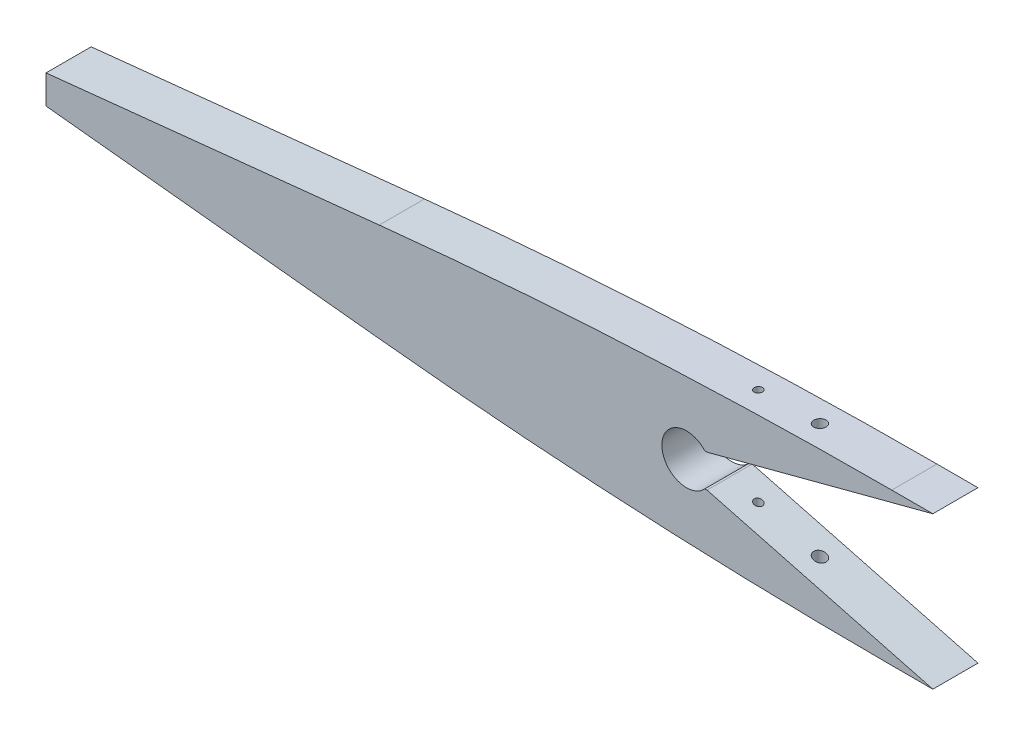
ISO-10303-21;
HEADER;
FILE_DESCRIPTION(('STEP AP214'),'2;1');
FILE_NAME('part.step','',(''),(''),'','','');
FILE_SCHEMA(('AUTOMOTIVE_DESIGN { 1 0 10303 214 1 1 1 1 }'));
ENDSEC;
DATA;
#1=APPLICATION_CONTEXT('core data for automotive mechanical design processes');
#2=APPLICATION_PROTOCOL_DEFINITION('international standard','automotive_design',2000,#1);
#3=PRODUCT_CONTEXT('',#1,'mechanical');
#4=PRODUCT('Part','Part','',(#3));
#5=PRODUCT_RELATED_PRODUCT_CATEGORY('part','',(#4));
#6=PRODUCT_DEFINITION_FORMATION('','',#4);
#7=PRODUCT_DEFINITION_CONTEXT('part definition',#1,'design');
#8=PRODUCT_DEFINITION('design','',#6,#7);
#9=PRODUCT_DEFINITION_SHAPE('','',#8);
#10=(LENGTH_UNIT() NAMED_UNIT(*) SI_UNIT(.MILLI.,.METRE.));
#11=(NAMED_UNIT(*) PLANE_ANGLE_UNIT() SI_UNIT($,.RADIAN.));
#12=(NAMED_UNIT(*) SI_UNIT($,.STERADIAN.) SOLID_ANGLE_UNIT());
#13=UNCERTAINTY_MEASURE_WITH_UNIT(LENGTH_MEASURE(1.E-05),#10,'distance_accuracy_value','');
#14=(GEOMETRIC_REPRESENTATION_CONTEXT(3) GLOBAL_UNCERTAINTY_ASSIGNED_CONTEXT((#13)) GLOBAL_UNIT_ASSIGNED_CONTEXT((#10,
#11,#12)) REPRESENTATION_CONTEXT('',''));
#15=CARTESIAN_POINT('',(0.,0.,0.));
#16=DIRECTION('',(0.,0.,1.));
#17=DIRECTION('',(1.,0.,0.));
#18=AXIS2_PLACEMENT_3D('',#15,#16,#17);
#19=CARTESIAN_POINT('',(-40.0000000000001,-1181.5,5.5));
#20=DIRECTION('',(0.,0.,-1.));
#21=DIRECTION('',(-1.,0.,0.));
#22=AXIS2_PLACEMENT_3D('',#19,#20,#21);
#23=CYLINDRICAL_SURFACE('',#22,1200.);
#24=CARTESIAN_POINT('',(-78.,17.8981824231681,1.));
#25=CARTESIAN_POINT('',(-78.0561923045698,17.8964021016881,0.999997511469249));
#26=CARTESIAN_POINT('',(-78.112425222722,17.8946165094137,0.995247784304634));
#27=CARTESIAN_POINT('',(-78.2233424947234,17.8910868344691,0.97636578145881));
#28=CARTESIAN_POINT('',(-78.2780249015019,17.8893428043943,0.962222210047299));
#29=CARTESIAN_POINT('',(-78.3842185929343,17.8859489689719,0.924953869738239));
#30=CARTESIAN_POINT('',(-78.4357313478532,17.8842991199639,0.901833301824797));
#31=CARTESIAN_POINT('',(-78.5341303227537,17.8811417671611,0.84727170926813));
#32=CARTESIAN_POINT('',(-78.581017693719,17.879634227958,0.815832761782682));
#33=CARTESIAN_POINT('',(-78.6688448755409,17.8768058328136,0.745526760569154));
#34=CARTESIAN_POINT('',(-78.7097853361787,17.8754849564773,0.706660519450606));
#35=CARTESIAN_POINT('',(-78.784561015701,17.8730692449622,0.622598289296068));
#36=CARTESIAN_POINT('',(-78.818395971903,17.8719744181402,0.57740206635067));
#37=CARTESIAN_POINT('',(-78.8779801540602,17.8700444611068,0.481988343305178));
#38=CARTESIAN_POINT('',(-78.9037334410808,17.8692092004646,0.431773381917891));
#39=CARTESIAN_POINT('',(-78.9464438970402,17.8678230497201,0.327728966665681));
#40=CARTESIAN_POINT('',(-78.9634011085648,17.8672721582409,0.273899530301524));
#41=CARTESIAN_POINT('',(-78.9880304900172,17.8664717807831,0.164181189129793));
#42=CARTESIAN_POINT('',(-78.9957069997004,17.8662221539299,0.108293259504111));
#43=CARTESIAN_POINT('',(-79.0015707600187,17.8660314879962,-0.00397858876548272));
#44=CARTESIAN_POINT('',(-78.9997580444487,17.8660904478167,-0.0603625056422744));
#45=CARTESIAN_POINT('',(-78.9866966264769,17.8665150936714,-0.172011848642425));
#46=CARTESIAN_POINT('',(-78.975450149958,17.8668807073511,-0.227277535460697));
#47=CARTESIAN_POINT('',(-78.943844333172,17.8679073730763,-0.335135735210378));
#48=CARTESIAN_POINT('',(-78.9234849825453,17.8685684254575,-0.387728245102819));
#49=CARTESIAN_POINT('',(-78.8742300378261,17.8701658967293,-0.488753760171055));
#50=CARTESIAN_POINT('',(-78.8453335170972,17.8711023455117,-0.537186313082427));
#51=CARTESIAN_POINT('',(-78.7798267506666,17.8732221904328,-0.628512663532799));
#52=CARTESIAN_POINT('',(-78.7432164936046,17.8744055869353,-0.671406452914571));
#53=CARTESIAN_POINT('',(-78.6633060701159,17.8769842541604,-0.750456507518725));
#54=CARTESIAN_POINT('',(-78.6200032177577,17.8783796099445,-0.786610054778484));
#55=CARTESIAN_POINT('',(-78.5279480298928,17.8813402491097,-0.851134715635319));
#56=CARTESIAN_POINT('',(-78.4791956785455,17.8829055329848,-0.879505806609433));
#57=CARTESIAN_POINT('',(-78.3775988240015,17.8861607046948,-0.927675197387078));
#58=CARTESIAN_POINT('',(-78.3247522587179,17.8878506552985,-0.947469143710317));
#59=CARTESIAN_POINT('',(-78.2164882670726,17.8913051860166,-0.977903208132851));
#60=CARTESIAN_POINT('',(-78.1610708346589,17.8930697663068,-0.988543304682029));
#61=CARTESIAN_POINT('',(-78.0492155969745,17.8966234419172,-1.0003708757492));
#62=CARTESIAN_POINT('',(-77.9927774111294,17.8984125463181,-1.00155474865937));
#63=CARTESIAN_POINT('',(-77.8805029908988,17.9019637503489,-0.994426750125098));
#64=CARTESIAN_POINT('',(-77.8246667571295,17.9037258499511,-0.986114868962242));
#65=CARTESIAN_POINT('',(-77.7151762144935,17.9071737675697,-0.960229270510509));
#66=CARTESIAN_POINT('',(-77.6615221040667,17.9088595786501,-0.942654712903967));
#67=CARTESIAN_POINT('',(-77.5579252683969,17.9121080504435,-0.898740843636251));
#68=CARTESIAN_POINT('',(-77.5079825396773,17.9136707112719,-0.872401540185299));
#69=CARTESIAN_POINT('',(-77.4132389062841,17.9166297845849,-0.811711529507555));
#70=CARTESIAN_POINT('',(-77.3684368335042,17.9180262348399,-0.777362647689904));
#71=CARTESIAN_POINT('',(-77.2852355019696,17.9206155263829,-0.701624106723934));
#72=CARTESIAN_POINT('',(-77.2468362318803,17.9218083680313,-0.660234460039761));
#73=CARTESIAN_POINT('',(-77.1775486834849,17.9239580225392,-0.571608511148883));
#74=CARTESIAN_POINT('',(-77.1466571358776,17.9249149381373,-0.524374767374718));
#75=CARTESIAN_POINT('',(-77.0932427802975,17.926568013743,-0.425387147485953));
#76=CARTESIAN_POINT('',(-77.0707199418596,17.9272641746999,-0.373633287827091));
#77=CARTESIAN_POINT('',(-77.0346927769226,17.9283771271634,-0.267099912885481));
#78=CARTESIAN_POINT('',(-77.0211843424603,17.928794045924,-0.212321788133247));
#79=CARTESIAN_POINT('',(-77.0035542030037,17.9293380834598,-0.101273789361552));
#80=CARTESIAN_POINT('',(-76.9994324967644,17.9294652022734,-0.0450039155399681));
#81=CARTESIAN_POINT('',(-77.000693047786,17.9294263166478,0.0674129024764315));
#82=CARTESIAN_POINT('',(-77.0060725700422,17.9292603965623,0.12355987739063));
#83=CARTESIAN_POINT('',(-77.0261771322758,17.9286399393485,0.234153368061977));
#84=CARTESIAN_POINT('',(-77.0409021866491,17.9281854017755,0.288599881199577));
#85=CARTESIAN_POINT('',(-77.0792790370669,17.9269996261495,0.394248102126137));
#86=CARTESIAN_POINT('',(-77.1029309896895,17.926268383243,0.445449752981682));
#87=CARTESIAN_POINT('',(-77.158487871994,17.9245485015111,0.54315311242878));
#88=CARTESIAN_POINT('',(-77.190392486903,17.923559872503,0.58965500018453));
#89=CARTESIAN_POINT('',(-77.2615542782081,17.9213512509488,0.676651116879112));
#90=CARTESIAN_POINT('',(-77.300812773185,17.9201312169103,0.717144266089301));
#91=CARTESIAN_POINT('',(-77.3855760051421,17.9174921605554,0.790975609200066));
#92=CARTESIAN_POINT('',(-77.4310823058293,17.9160730884215,0.824312006530038));
#93=CARTESIAN_POINT('',(-77.5270793329182,17.9130733919476,0.882899999760074));
#94=CARTESIAN_POINT('',(-77.5775746660115,17.9114926182497,0.908144030446657));
#95=CARTESIAN_POINT('',(-77.6820435661041,17.9082150429122,0.949767391137813));
#96=CARTESIAN_POINT('',(-77.736012888976,17.9065183827004,0.966157316398453));
#97=CARTESIAN_POINT('',(-77.8252710657469,17.9037060374184,0.985244099595972));
#98=CARTESIAN_POINT('',(-77.8599809400399,17.9026109119795,0.990770684049047));
#99=CARTESIAN_POINT('',(-77.929788589902,17.9004053514643,0.99814941224923));
#100=CARTESIAN_POINT('',(-77.9648863655719,17.8992949163839,1.00000155504138));
#101=CARTESIAN_POINT('',(-78.,17.8981824231681,1.));
#102=B_SPLINE_CURVE_WITH_KNOTS('',3,(#24,#25,#26,#27,#28,#29,#30,#31,#32,#33,#34,#35,#36,#37,
#38,#39,#40,#41,#42,#43,#44,#45,#46,#47,#48,#49,#50,#51,#52,#53,#54,#55,#56,#57,#58,#59,#60,#61,
#62,#63,#64,#65,#66,#67,#68,#69,#70,#71,#72,#73,#74,#75,#76,#77,#78,#79,#80,#81,#82,#83,#84,#85,
#86,#87,#88,#89,#90,#91,#92,#93,#94,#95,#96,#97,#98,#99,#100,#101),.UNSPECIFIED.,.T.,.F.,(4,2,2,
2,2,2,2,2,2,2,2,2,2,2,2,2,2,2,2,2,2,2,2,2,2,2,2,2,2,2,2,2,2,2,2,2,2,2,4),(0.,0.168533301244125,
0.337269624977658,0.505927079804669,0.674542459362489,0.843139401504723,1.01174257539011,
1.18026088945725,1.34877838764196,1.51721705472355,1.68565512192904,1.85405345758049,
2.02245198466915,2.19086879668608,2.35928585673646,2.52777068376531,2.69625600056052,
2.8648267351492,3.03339786658832,3.20203319893826,3.37066870387807,3.53931951020436,
3.70797015855043,3.87658240836244,4.04519435968615,4.21373275542084,4.38227053760755,
4.55073146272303,4.71919236549278,4.88760478334539,5.05601746062319,5.22443309200342,
5.39284230062544,5.56128173466327,5.72976340300015,5.89840212151824,6.06683858913986,
6.1721522123517,6.27746586293365),.UNSPECIFIED.);
#103=CARTESIAN_POINT('',(-78.,17.8981824231681,1.));
#104=VERTEX_POINT('',#103);
#105=EDGE_CURVE('E220',#104,#104,#102,.T.);
#106=ORIENTED_EDGE('',*,*,#105,.T.);
#107=EDGE_LOOP('',(#106));
#108=FACE_BOUND('',#107,.T.);
#109=CARTESIAN_POINT('',(-63.,18.279563086486,1.5));
#110=CARTESIAN_POINT('',(-63.084268391004,18.2779476328829,1.49999626486385));
#111=CARTESIAN_POINT('',(-63.1685977138507,18.2763220598821,1.49287503181335));
#112=CARTESIAN_POINT('',(-63.334933740548,18.2730984693798,1.46456577117715));
#113=CARTESIAN_POINT('',(-63.4169375241157,18.2715004874318,1.44336080856874));
#114=CARTESIAN_POINT('',(-63.576188843425,18.2683816721048,1.38748712495966));
#115=CARTESIAN_POINT('',(-63.6534386155935,18.2668608025102,1.35282479166792));
#116=CARTESIAN_POINT('',(-63.801001024803,18.2639425335107,1.27102835443357));
#117=CARTESIAN_POINT('',(-63.8713153833967,18.2625451034738,1.22389735629278));
#118=CARTESIAN_POINT('',(-64.0030372452952,18.2599170461059,1.11849505816259));
#119=CARTESIAN_POINT('',(-64.0644444649641,18.2586864240868,1.06022340355084));
#120=CARTESIAN_POINT('',(-64.1766062422245,18.2564314750849,0.934191730724932));
#121=CARTESIAN_POINT('',(-64.2273603906187,18.2554071560266,0.866431348203955));
#122=CARTESIAN_POINT('',(-64.3167616314828,18.2535984984839,0.723362077671816));
#123=CARTESIAN_POINT('',(-64.3554111586081,18.2528141117417,0.648054711645801));
#124=CARTESIAN_POINT('',(-64.4195183805673,18.2515110038544,0.492018116121068));
#125=CARTESIAN_POINT('',(-64.4449761166913,18.2509922818778,0.411288903593513));
#126=CARTESIAN_POINT('',(-64.481972709497,18.2502379071288,0.246716088114577));
#127=CARTESIAN_POINT('',(-64.493514123939,18.2500022023389,0.162873060390027));
#128=CARTESIAN_POINT('',(-64.5023585114665,18.2498216077616,-0.00556078360040504));
#129=CARTESIAN_POINT('',(-64.4996615203241,18.2498767172437,-0.0901515979870423));
#130=CARTESIAN_POINT('',(-64.4801067875594,18.2502758763135,-0.257671390609197));
#131=CARTESIAN_POINT('',(-64.4632503957534,18.2506198983593,-0.340600526481078));
#132=CARTESIAN_POINT('',(-64.4158576809386,18.2515853087197,-0.502451478277224));
#133=CARTESIAN_POINT('',(-64.3853213428681,18.2522066973397,-0.58137328978931));
#134=CARTESIAN_POINT('',(-64.3114347353344,18.2537061829468,-0.732973184581863));
#135=CARTESIAN_POINT('',(-64.2680839043511,18.254584291183,-0.805650994075276));
#136=CARTESIAN_POINT('',(-64.169800215829,18.256568294269,-0.942697088136512));
#137=CARTESIAN_POINT('',(-64.1148673540699,18.2576741892017,-1.00706536967632));
#138=CARTESIAN_POINT('',(-63.9949696353639,18.2600781070473,-1.12567649895182));
#139=CARTESIAN_POINT('',(-63.9300031649375,18.2613761608593,-1.17991771507513));
#140=CARTESIAN_POINT('',(-63.791889064135,18.2641229747671,-1.27672372222491));
#141=CARTESIAN_POINT('',(-63.7187414238095,18.265571735046,-1.3192884990509));
#142=CARTESIAN_POINT('',(-63.5663259851008,18.2685752193436,-1.39154195577727));
#143=CARTESIAN_POINT('',(-63.4870569940957,18.2701299640042,-1.42122811904522));
#144=CARTESIAN_POINT('',(-63.3246612529595,18.273298072829,-1.46687047473541));
#145=CARTESIAN_POINT('',(-63.2415344996476,18.2749114370416,-1.4828266558368));
#146=CARTESIAN_POINT('',(-63.0737707826003,18.2781495509018,-1.50055776108226));
#147=CARTESIAN_POINT('',(-62.9891336147561,18.2797743020699,-1.50233075382314));
#148=CARTESIAN_POINT('',(-62.8207625486686,18.2829886640278,-1.49163994264656));
#149=CARTESIAN_POINT('',(-62.7370286507214,18.284578274806,-1.47917613406473));
#150=CARTESIAN_POINT('',(-62.5728394711434,18.2876785765638,-1.44036458166167));
#151=CARTESIAN_POINT('',(-62.4923842565002,18.2891892659312,-1.41401655432095));
#152=CARTESIAN_POINT('',(-62.3370387947724,18.2920914638732,-1.34818358453718));
#153=CARTESIAN_POINT('',(-62.2621485449322,18.2934829725069,-1.30869864859895));
#154=CARTESIAN_POINT('',(-62.1200667185898,18.2961108889721,-1.21771631068243));
#155=CARTESIAN_POINT('',(-62.0528744223044,18.2973473113057,-1.16622003317215));
#156=CARTESIAN_POINT('',(-61.9280890806706,18.2996344440375,-1.05267420127906));
#157=CARTESIAN_POINT('',(-61.8704960315715,18.3006851545084,-0.990624651019752));
#158=CARTESIAN_POINT('',(-61.7665539340837,18.302575359673,-0.85774412586558));
#159=CARTESIAN_POINT('',(-61.7202031139188,18.30341488765,-0.786914537367736));
#160=CARTESIAN_POINT('',(-61.6400508244645,18.3048632232596,-0.638476893145027));
#161=CARTESIAN_POINT('',(-61.6062493309074,18.3054720313385,-0.560868850528605));
#162=CARTESIAN_POINT('',(-61.552160509812,18.3064448543933,-0.401090278981988));
#163=CARTESIAN_POINT('',(-61.5318710819865,18.3068089074137,-0.318920461276735));
#164=CARTESIAN_POINT('',(-61.5053745289112,18.3072841271803,-0.152340007949402));
#165=CARTESIAN_POINT('',(-61.4991674200805,18.3073952936317,-0.0679293697147729));
#166=CARTESIAN_POINT('',(-61.5010118747468,18.3073622415458,0.100727797739616));
#167=CARTESIAN_POINT('',(-61.5090620713395,18.3072180474907,0.1849743419165));
#168=CARTESIAN_POINT('',(-61.5391897736638,18.3066775642791,0.350920078164403));
#169=CARTESIAN_POINT('',(-61.5612673053387,18.3062812746562,0.432619265523836));
#170=CARTESIAN_POINT('',(-61.6188228982638,18.3052455792231,0.591152554846929));
#171=CARTESIAN_POINT('',(-61.6543012031258,18.3046061689932,0.667986568337284));
#172=CARTESIAN_POINT('',(-61.7376490054178,18.3030989897291,0.814604503166964));
#173=CARTESIAN_POINT('',(-61.7855180206612,18.3022312295813,0.88438869870427));
#174=CARTESIAN_POINT('',(-61.8922870792391,18.3002878017794,1.01492982275097));
#175=CARTESIAN_POINT('',(-61.951186996895,18.2992121364941,1.07568685409553));
#176=CARTESIAN_POINT('',(-62.0783648864703,18.2968785756373,1.18646570917636));
#177=CARTESIAN_POINT('',(-62.1466451924555,18.295620634707,1.23648485310533));
#178=CARTESIAN_POINT('',(-62.290668673416,18.292953503864,1.32437673103315));
#179=CARTESIAN_POINT('',(-62.3664165392296,18.2915442188324,1.36224176591028));
#180=CARTESIAN_POINT('',(-62.52313263984,18.2886124699497,1.42467391328725));
#181=CARTESIAN_POINT('',(-62.6040944922602,18.2870901441337,1.4492569504207));
#182=CARTESIAN_POINT('',(-62.7379765466488,18.2845586151354,1.47787803152235));
#183=CARTESIAN_POINT('',(-62.7900274189789,18.2835710620329,1.48616343820907));
#184=CARTESIAN_POINT('',(-62.8947109304134,18.2815780185139,1.49722558966781));
#185=CARTESIAN_POINT('',(-62.9473435695686,18.2805725280958,1.50000233395862));
#186=CARTESIAN_POINT('',(-63.,18.279563086486,1.5));
#187=B_SPLINE_CURVE_WITH_KNOTS('',3,(#109,#110,#111,#112,#113,#114,#115,#116,#117,#118,#119,
#120,#121,#122,#123,#124,#125,#126,#127,#128,#129,#130,#131,#132,#133,#134,#135,#136,#137,#138,
#139,#140,#141,#142,#143,#144,#145,#146,#147,#148,#149,#150,#151,#152,#153,#154,#155,#156,#157,
#158,#159,#160,#161,#162,#163,#164,#165,#166,#167,#168,#169,#170,#171,#172,#173,#174,#175,#176,
#177,#178,#179,#180,#181,#182,#183,#184,#185,#186),.UNSPECIFIED.,.T.,.F.,(4,2,2,2,2,2,2,2,2,2,2,
2,2,2,2,2,2,2,2,2,2,2,2,2,2,2,2,2,2,2,2,2,2,2,2,2,2,2,4),(0.,0.252659404385438,
0.505623171197716,0.758467012112514,1.01124793171994,1.26403689903027,1.51683557449197,
1.76958337074934,2.02233037590642,2.27503092016356,2.5277308295452,2.78040665176718,
3.03308275218645,3.28576992630089,3.53845719249512,3.79118513508948,4.04391338504145,
4.29669099884224,4.54946882106691,4.80228106485981,5.05509339148112,5.30791088079833,
5.56072824493142,5.81352195050695,6.06631555730846,6.31906929789117,6.57182254969948,
6.82453650489413,7.07725075473824,7.32994077718019,7.58263126696936,7.83532635062235,
8.08801160208105,8.34069397479273,8.5934393352102,8.84634448476051,9.09894573350175,
9.25682392518391,9.41470213065773),.UNSPECIFIED.);
#188=CARTESIAN_POINT('',(-63.,18.279563086486,1.5));
#189=VERTEX_POINT('',#188);
#190=EDGE_CURVE('E139',#189,#189,#187,.T.);
#191=ORIENTED_EDGE('',*,*,#190,.T.);
#192=EDGE_LOOP('',(#191));
#193=FACE_BOUND('',#192,.T.);
#194=CARTESIAN_POINT('',(-40.0000000000001,-1181.5,-5.5));
#195=DIRECTION('',(0.,0.,1.));
#196=DIRECTION('',(1.,0.,0.));
#197=AXIS2_PLACEMENT_3D('',#194,#195,#196);
#198=CIRCLE('',#197,1200.);
#199=CARTESIAN_POINT('',(-40.,18.5,-5.5));
#200=VERTEX_POINT('',#199);
#201=CARTESIAN_POINT('',(-164.827821896912,11.9898469951354,-5.5));
#202=VERTEX_POINT('',#201);
#203=EDGE_CURVE('E125',#200,#202,#198,.T.);
#204=ORIENTED_EDGE('',*,*,#203,.T.);
#205=DIRECTION('',(0.,0.,-1.));
#206=VECTOR('',#205,1.);
#207=CARTESIAN_POINT('',(-164.827821896912,11.9898469951354,5.5));
#208=LINE('',#207,#206);
#209=CARTESIAN_POINT('',(-164.827821896912,11.9898469951354,5.5));
#210=VERTEX_POINT('',#209);
#211=EDGE_CURVE('E11',#210,#202,#208,.T.);
#212=ORIENTED_EDGE('',*,*,#211,.F.);
#213=CARTESIAN_POINT('',(-40.0000000000001,-1181.5,5.5));
#214=DIRECTION('',(0.,0.,1.));
#215=DIRECTION('',(1.,0.,0.));
#216=AXIS2_PLACEMENT_3D('',#213,#214,#215);
#217=CIRCLE('',#216,1200.);
#218=CARTESIAN_POINT('',(-40.,18.5,5.5));
#219=VERTEX_POINT('',#218);
#220=EDGE_CURVE('E168',#219,#210,#217,.T.);
#221=ORIENTED_EDGE('',*,*,#220,.F.);
#222=DIRECTION('',(0.,0.,-1.));
#223=VECTOR('',#222,1.);
#224=CARTESIAN_POINT('',(-40.,18.5,5.5));
#225=LINE('',#224,#223);
#226=EDGE_CURVE('E138',#219,#200,#225,.T.);
#227=ORIENTED_EDGE('',*,*,#226,.T.);
#228=EDGE_LOOP('',(#204,#212,#221,#227));
#229=FACE_BOUND('',#228,.T.);
#230=ADVANCED_FACE('F30',(#108,#193,#229),#23,.T.);
#231=CARTESIAN_POINT('',(-164.827821896912,11.9898469951354,5.5));
#232=DIRECTION('',(0.10402318491409,-0.994574872495947,0.));
#233=DIRECTION('',(0.994574872495947,0.10402318491409,0.));
#234=AXIS2_PLACEMENT_3D('',#231,#232,#233);
#235=PLANE('',#234);
#236=DIRECTION('',(-0.994574872495947,-0.104023184914089,0.));
#237=VECTOR('',#236,1.);
#238=CARTESIAN_POINT('',(-164.827821896912,11.9898469951354,-5.5));
#239=LINE('',#238,#237);
#240=CARTESIAN_POINT('',(-246.,3.5,-5.5));
#241=VERTEX_POINT('',#240);
#242=EDGE_CURVE('E121',#202,#241,#239,.T.);
#243=ORIENTED_EDGE('',*,*,#242,.T.);
#244=DIRECTION('',(0.,0.,-1.));
#245=VECTOR('',#244,1.);
#246=CARTESIAN_POINT('',(-246.,3.5,5.5));
#247=LINE('',#246,#245);
#248=CARTESIAN_POINT('',(-246.,3.5,5.5));
#249=VERTEX_POINT('',#248);
#250=EDGE_CURVE('E39',#249,#241,#247,.T.);
#251=ORIENTED_EDGE('',*,*,#250,.F.);
#252=DIRECTION('',(-0.994574872495947,-0.104023184914089,0.));
#253=VECTOR('',#252,1.);
#254=CARTESIAN_POINT('',(-164.827821896912,11.9898469951354,5.5));
#255=LINE('',#254,#253);
#256=EDGE_CURVE('E134',#210,#249,#255,.T.);
#257=ORIENTED_EDGE('',*,*,#256,.F.);
#258=ORIENTED_EDGE('',*,*,#211,.T.);
#259=EDGE_LOOP('',(#243,#251,#257,#258));
#260=FACE_BOUND('',#259,.T.);
#261=ADVANCED_FACE('F133',(#260),#235,.F.);
#262=CARTESIAN_POINT('',(-246.,-3.5,5.5));
#263=DIRECTION('',(1.,0.,0.));
#264=DIRECTION('',(0.,0.,-1.));
#265=AXIS2_PLACEMENT_3D('',#262,#263,#264);
#266=PLANE('',#265);
#267=DIRECTION('',(0.,-1.,0.));
#268=VECTOR('',#267,1.);
#269=CARTESIAN_POINT('',(-246.,-3.5,-5.5));
#270=LINE('',#269,#268);
#271=CARTESIAN_POINT('',(-246.,-3.5,-5.5));
#272=VERTEX_POINT('',#271);
#273=EDGE_CURVE('E127',#241,#272,#270,.T.);
#274=ORIENTED_EDGE('',*,*,#273,.T.);
#275=DIRECTION('',(0.,0.,-1.));
#276=VECTOR('',#275,1.);
#277=CARTESIAN_POINT('',(-246.,-3.5,5.5));
#278=LINE('',#277,#276);
#279=CARTESIAN_POINT('',(-246.,-3.5,5.5));
#280=VERTEX_POINT('',#279);
#281=EDGE_CURVE('E214',#280,#272,#278,.T.);
#282=ORIENTED_EDGE('',*,*,#281,.F.);
#283=DIRECTION('',(0.,-1.,0.));
#284=VECTOR('',#283,1.);
#285=CARTESIAN_POINT('',(-246.,-3.5,5.5));
#286=LINE('',#285,#284);
#287=EDGE_CURVE('E171',#249,#280,#286,.T.);
#288=ORIENTED_EDGE('',*,*,#287,.F.);
#289=ORIENTED_EDGE('',*,*,#250,.T.);
#290=EDGE_LOOP('',(#274,#282,#288,#289));
#291=FACE_BOUND('',#290,.T.);
#292=ADVANCED_FACE('F269',(#291),#266,.F.);
#293=CARTESIAN_POINT('',(-164.827821896912,-11.9898469951354,5.5));
#294=DIRECTION('',(0.10402318491409,0.994574872495947,0.));
#295=DIRECTION('',(-0.994574872495947,0.10402318491409,0.));
#296=AXIS2_PLACEMENT_3D('',#293,#294,#295);
#297=PLANE('',#296);
#298=DIRECTION('',(0.994574872495947,-0.10402318491409,0.));
#299=VECTOR('',#298,1.);
#300=CARTESIAN_POINT('',(-164.827821896912,-11.9898469951354,-5.5));
#301=LINE('',#300,#299);
#302=CARTESIAN_POINT('',(-164.827821896912,-11.9898469951356,-5.5));
#303=VERTEX_POINT('',#302);
#304=EDGE_CURVE('E150',#272,#303,#301,.T.);
#305=ORIENTED_EDGE('',*,*,#304,.T.);
#306=DIRECTION('',(0.,0.,-1.));
#307=VECTOR('',#306,1.);
#308=CARTESIAN_POINT('',(-164.827821896912,-11.9898469951356,5.5));
#309=LINE('',#308,#307);
#310=CARTESIAN_POINT('',(-164.827821896912,-11.9898469951356,5.5));
#311=VERTEX_POINT('',#310);
#312=EDGE_CURVE('E211',#311,#303,#309,.T.);
#313=ORIENTED_EDGE('',*,*,#312,.F.);
#314=DIRECTION('',(0.994574872495947,-0.10402318491409,0.));
#315=VECTOR('',#314,1.);
#316=CARTESIAN_POINT('',(-164.827821896912,-11.9898469951354,5.5));
#317=LINE('',#316,#315);
#318=EDGE_CURVE('E173',#280,#311,#317,.T.);
#319=ORIENTED_EDGE('',*,*,#318,.F.);
#320=ORIENTED_EDGE('',*,*,#281,.T.);
#321=EDGE_LOOP('',(#305,#313,#319,#320));
#322=FACE_BOUND('',#321,.T.);
#323=ADVANCED_FACE('F263',(#322),#297,.F.);
#324=CARTESIAN_POINT('',(-40.0000000000001,1181.5,5.5));
#325=DIRECTION('',(0.,0.,-1.));
#326=DIRECTION('',(-1.,0.,0.));
#327=AXIS2_PLACEMENT_3D('',#324,#325,#326);
#328=CYLINDRICAL_SURFACE('',#327,1200.);
#329=CARTESIAN_POINT('',(-78.,-17.8981824231681,1.));
#330=CARTESIAN_POINT('',(-77.9438095570607,-17.8999626743733,0.999997511841235));
#331=CARTESIAN_POINT('',(-77.8875782605472,-17.9017402361374,0.995248100710178));
#332=CARTESIAN_POINT('',(-77.776663671379,-17.9052387625665,0.976367108322347));
#333=CARTESIAN_POINT('',(-77.7219823240673,-17.9069596565106,0.962224237636076));
#334=CARTESIAN_POINT('',(-77.6157901763367,-17.9102947492261,0.924957454943618));
#335=CARTESIAN_POINT('',(-77.5642779105168,-17.9119089973369,0.901837730598396));
#336=CARTESIAN_POINT('',(-77.4658795907971,-17.9149866884113,0.847277911000365));
#337=CARTESIAN_POINT('',(-77.4189923862197,-17.9164501688887,0.815839892475271));
#338=CARTESIAN_POINT('',(-77.3311661875213,-17.9191869253241,0.745536554542783));
#339=CARTESIAN_POINT('',(-77.2902264319194,-17.9204602256323,0.70667218744495));
#340=CARTESIAN_POINT('',(-77.2154517249991,-17.922782656732,0.622614173463215));
#341=CARTESIAN_POINT('',(-77.1816170368252,-17.9238317792207,0.577420292261564));
#342=CARTESIAN_POINT('',(-77.1220322145506,-17.9256774038633,0.482010752397367));
#343=CARTESIAN_POINT('',(-77.0962781819874,-17.9264740278354,0.431797530750296));
#344=CARTESIAN_POINT('',(-77.053565820216,-17.9277942916162,0.327756801616687));
#345=CARTESIAN_POINT('',(-77.0366074510429,-17.9283179326654,0.273929310553562));
#346=CARTESIAN_POINT('',(-77.0119745951541,-17.9290783076662,0.164212184994893));
#347=CARTESIAN_POINT('',(-77.0042962234525,-17.9293151616787,0.108323423536548));
#348=CARTESIAN_POINT('',(-76.9984290686087,-17.9294961586855,-0.00395033778985625));
#349=CARTESIAN_POINT('',(-77.0002402538572,-17.9294403026547,-0.0603353360043511));
#350=CARTESIAN_POINT('',(-77.0132992187128,-17.9290373851685,-0.171988948328424));
#351=CARTESIAN_POINT('',(-77.0245450723815,-17.928690383146,-0.227257787926257));
#352=CARTESIAN_POINT('',(-77.056150752336,-17.9277143451834,-0.335122406198049));
#353=CARTESIAN_POINT('',(-77.0765105884822,-17.9270853089382,-0.387718181979987));
#354=CARTESIAN_POINT('',(-77.1257673189202,-17.9255616773973,-0.488749317596763));
#355=CARTESIAN_POINT('',(-77.1546650094635,-17.9246670573328,-0.537184288845521));
#356=CARTESIAN_POINT('',(-77.2201750563672,-17.9226359540912,-0.628515152850696));
#357=CARTESIAN_POINT('',(-77.2567874218875,-17.9214994706269,-0.67141103903034));
#358=CARTESIAN_POINT('',(-77.3367009296429,-17.9190145059791,-0.750462718766892));
#359=CARTESIAN_POINT('',(-77.380004437612,-17.9176659498118,-0.786616118420015));
#360=CARTESIAN_POINT('',(-77.4720609335613,-17.9147934582372,-0.8511403005693));
#361=CARTESIAN_POINT('',(-77.5208139360237,-17.9132695223638,-0.879511062382224));
#362=CARTESIAN_POINT('',(-77.6224100354448,-17.9100870195827,-0.927678700101578));
#363=CARTESIAN_POINT('',(-77.6752550493625,-17.9084283895577,-0.947471528564486));
#364=CARTESIAN_POINT('',(-77.7835153305017,-17.905022876038,-0.977903888928883));
#365=CARTESIAN_POINT('',(-77.8389306038278,-17.9032759923338,-0.98854339908962));
#366=CARTESIAN_POINT('',(-77.9507815194917,-17.8997420848618,-1.00037062856367));
#367=CARTESIAN_POINT('',(-78.0072175523588,-17.8979550456648,-1.0015546502433));
#368=CARTESIAN_POINT('',(-78.1194872877155,-17.8943921178387,-0.994427785426345));
#369=CARTESIAN_POINT('',(-78.1753209894244,-17.8926162292241,-0.986116886624779));
#370=CARTESIAN_POINT('',(-78.2848089704863,-17.8891263489767,-0.960233652217093));
#371=CARTESIAN_POINT('',(-78.3384629497539,-17.8874123658702,-0.942660046024057));
#372=CARTESIAN_POINT('',(-78.4420595138033,-17.8840964215386,-0.898748296490603));
#373=CARTESIAN_POINT('',(-78.4920021010654,-17.8824944602387,-0.872410159007522));
#374=CARTESIAN_POINT('',(-78.5867475444491,-17.8794500338543,-0.811721428017472));
#375=CARTESIAN_POINT('',(-78.631551368055,-17.8780075387487,-0.777372346451723));
#376=CARTESIAN_POINT('',(-78.7147560505924,-17.8753246587704,-0.701632837614517));
#377=CARTESIAN_POINT('',(-78.7531569207884,-17.8740842735422,-0.660242422730943));
#378=CARTESIAN_POINT('',(-78.8224472487807,-17.8718434223694,-0.571614509484403));
#379=CARTESIAN_POINT('',(-78.8533400138194,-17.8708428507922,-0.524379599448448));
#380=CARTESIAN_POINT('',(-78.9067564387838,-17.8691112500445,-0.425389044766558));
#381=CARTESIAN_POINT('',(-78.9292801313266,-17.8683802198235,-0.37363341774033));
#382=CARTESIAN_POINT('',(-78.965307615026,-17.867210294442,-0.267098407714894));
#383=CARTESIAN_POINT('',(-78.9788159147315,-17.8667712532596,-0.212320550978178));
#384=CARTESIAN_POINT('',(-78.9964458676324,-17.8661981599624,-0.101272961602289));
#385=CARTESIAN_POINT('',(-79.0005675247259,-17.866064107721,-0.0450032295826883));
#386=CARTESIAN_POINT('',(-78.9993069453199,-17.8661050980567,0.0674109156485293));
#387=CARTESIAN_POINT('',(-78.9939278431163,-17.8662800386973,0.123555364073284));
#388=CARTESIAN_POINT('',(-78.9738250053265,-17.8669334545759,0.234143849576105));
#389=CARTESIAN_POINT('',(-78.9591012557436,-17.8674119302686,0.288587884107089));
#390=CARTESIAN_POINT('',(-78.9207279713706,-17.8686577946925,0.394231328341517));
#391=CARTESIAN_POINT('',(-78.8970782809847,-17.8694251884601,0.4454306814659));
#392=CARTESIAN_POINT('',(-78.8415269,-17.8712254998377,0.543129900724581));
#393=CARTESIAN_POINT('',(-78.80962552217,-17.8722584073839,0.589629944886713));
#394=CARTESIAN_POINT('',(-78.7384695776985,-17.8745587757839,0.676624990737614));
#395=CARTESIAN_POINT('',(-78.6992133848995,-17.8758262885085,0.717118660856194));
#396=CARTESIAN_POINT('',(-78.6144548594173,-17.8785581165731,0.790951544347248));
#397=CARTESIAN_POINT('',(-78.5689509613476,-17.880022481233,0.824288959309541));
#398=CARTESIAN_POINT('',(-78.4729564201835,-17.8831055718505,0.882880925060902));
#399=CARTESIAN_POINT('',(-78.4224609500679,-17.8847244471719,0.908127549721704));
#400=CARTESIAN_POINT('',(-78.3179910032604,-17.888066592868,0.949755901272914));
#401=CARTESIAN_POINT('',(-78.2640207711006,-17.8897897357272,0.966148222375121));
#402=CARTESIAN_POINT('',(-78.1747562838106,-17.892633448501,0.985239438483833));
#403=CARTESIAN_POINT('',(-78.1400411838709,-17.8937378851609,0.990767752180665));
#404=CARTESIAN_POINT('',(-78.0702227089306,-17.8959560391285,0.998148811022522));
#405=CARTESIAN_POINT('',(-78.0351193338185,-17.8970697564389,1.00000155511282));
#406=CARTESIAN_POINT('',(-78.,-17.8981824231681,1.));
#407=B_SPLINE_CURVE_WITH_KNOTS('',3,(#329,#330,#331,#332,#333,#334,#335,#336,#337,#338,#339,
#340,#341,#342,#343,#344,#345,#346,#347,#348,#349,#350,#351,#352,#353,#354,#355,#356,#357,#358,
#359,#360,#361,#362,#363,#364,#365,#366,#367,#368,#369,#370,#371,#372,#373,#374,#375,#376,#377,
#378,#379,#380,#381,#382,#383,#384,#385,#386,#387,#388,#389,#390,#391,#392,#393,#394,#395,#396,
#397,#398,#399,#400,#401,#402,#403,#404,#405,#406),.UNSPECIFIED.,.T.,.F.,(4,2,2,2,2,2,2,2,2,2,2,
2,2,2,2,2,2,2,2,2,2,2,2,2,2,2,2,2,2,2,2,2,2,2,2,2,2,2,4),(0.,0.168527698476664,
0.337258307566258,0.505910298988337,0.674520224774949,0.843108543547335,1.0117031050868,
1.18021620370989,1.34872853665316,1.51717029898716,1.68561150025043,1.85401832527137,
2.02242533248987,2.19084805052467,2.35927096853257,2.52775357132561,2.69623662187583,
2.8647990837628,3.03336194601437,3.20199072270402,3.37061971792904,3.53927185040408,
3.70792387016913,3.87654408520805,4.04516400359491,4.21370951148867,4.38225436249763,
4.5507148618597,4.71917529126162,4.88758015602804,5.05598527303909,5.22439332580312,
5.3927949962312,5.56123394448546,5.72971517303791,5.89836095292266,6.06680449790107,
6.17213519992968,6.27746593218353),.UNSPECIFIED.);
#408=CARTESIAN_POINT('',(-78.,-17.8981824231681,1.));
#409=VERTEX_POINT('',#408);
#410=EDGE_CURVE('E226',#409,#409,#407,.T.);
#411=ORIENTED_EDGE('',*,*,#410,.T.);
#412=EDGE_LOOP('',(#411));
#413=FACE_BOUND('',#412,.T.);
#414=CARTESIAN_POINT('',(-63.,-18.279563086486,1.5));
#415=CARTESIAN_POINT('',(-62.9157341421218,-18.2811784661517,1.49999626537085));
#416=CARTESIAN_POINT('',(-62.8314070259426,-18.2827860693684,1.49287546225001));
#417=CARTESIAN_POINT('',(-62.6650746501325,-18.2859397968327,1.46456757628875));
#418=CARTESIAN_POINT('',(-62.5830723084334,-18.2874858447246,1.44336356699848));
#419=CARTESIAN_POINT('',(-62.4238230902503,-18.2904727485298,1.38749200252342));
#420=CARTESIAN_POINT('',(-62.3465739839619,-18.2919136538267,1.35283081692579));
#421=CARTESIAN_POINT('',(-62.1990124669922,-18.2946529712941,1.27103679181813));
#422=CARTESIAN_POINT('',(-62.1286983351766,-18.295951418829,1.22390705752137));
#423=CARTESIAN_POINT('',(-61.9969778117579,-18.2983736087522,1.11850838253607));
#424=CARTESIAN_POINT('',(-61.9355715518016,-18.2994973485584,1.06023927725164));
#425=CARTESIAN_POINT('',(-61.8234110989732,-18.3015427073451,0.934213339505747));
#426=CARTESIAN_POINT('',(-61.7726573159219,-18.3024643185493,0.866456142186721));
#427=CARTESIAN_POINT('',(-61.683255206698,-18.3040833610534,0.723392563724161));
#428=CARTESIAN_POINT('',(-61.6446046665989,-18.3047808333533,0.648087566555707));
#429=CARTESIAN_POINT('',(-61.5804948541377,-18.305935672853,0.492055990275512));
#430=CARTESIAN_POINT('',(-61.5550355440438,-18.3063930407395,0.411329426672269));
#431=CARTESIAN_POINT('',(-61.5180342240754,-18.3070572176029,0.246758271008589));
#432=CARTESIAN_POINT('',(-61.5064902750925,-18.3072640614904,0.16291411506423));
#433=CARTESIAN_POINT('',(-61.4976412658055,-18.3074226476949,-0.00552232443309925));
#434=CARTESIAN_POINT('',(-61.5003361727091,-18.3073743905994,-0.0901146062626771));
#435=CARTESIAN_POINT('',(-61.5198875619682,-18.3070238721335,-0.257640204847128));
#436=CARTESIAN_POINT('',(-61.5367431035577,-18.3067216276367,-0.340573631433813));
#437=CARTESIAN_POINT('',(-61.5841356274428,-18.3058699832412,-0.502433318949556));
#438=CARTESIAN_POINT('',(-61.614672624125,-18.3053205830826,-0.581359575664825));
#439=CARTESIAN_POINT('',(-61.688561659968,-18.3039871794402,-0.732967124023943));
#440=CARTESIAN_POINT('',(-61.7319140835107,-18.3032031689195,-0.805648228268285));
#441=CARTESIAN_POINT('',(-61.8302022394343,-18.3014188514396,-0.942700471833768));
#442=CARTESIAN_POINT('',(-61.8851379730317,-18.3004185444577,-1.00707161028215));
#443=CARTESIAN_POINT('',(-62.0050398942548,-18.2982254555702,-1.125684955388));
#444=CARTESIAN_POINT('',(-62.0700072589708,-18.2970326510765,-1.17992597174593));
#445=CARTESIAN_POINT('',(-62.2081231445968,-18.2944840800455,-1.27673132891321));
#446=CARTESIAN_POINT('',(-62.2812716736022,-18.2931283133468,-1.319295658168));
#447=CARTESIAN_POINT('',(-62.4336860877362,-18.2902881471846,-1.39154672844212));
#448=CARTESIAN_POINT('',(-62.5129529678701,-18.2888037267938,-1.42123136966514));
#449=CARTESIAN_POINT('',(-62.6753436598606,-18.2857456147934,-1.46687140472614));
#450=CARTESIAN_POINT('',(-62.7584674749717,-18.2841719231085,-1.48282678697934));
#451=CARTESIAN_POINT('',(-62.9262253108621,-18.2809780249106,-1.50055742576339));
#452=CARTESIAN_POINT('',(-63.0108595494855,-18.2793578116672,-1.50233062000014));
#453=CARTESIAN_POINT('',(-63.1792242416178,-18.2761168876296,-1.49164134920058));
#454=CARTESIAN_POINT('',(-63.2629546946071,-18.2744961768351,-1.47917887597959));
#455=CARTESIAN_POINT('',(-63.4271403890917,-18.2713014734355,-1.44037053711169));
#456=CARTESIAN_POINT('',(-63.5075954252993,-18.2697274837603,-1.41402380270349));
#457=CARTESIAN_POINT('',(-63.662940517273,-18.266673686034,-1.34819371355884));
#458=CARTESIAN_POINT('',(-63.7378305744417,-18.2651938779592,-1.30871036213342));
#459=CARTESIAN_POINT('',(-63.8799148613946,-18.2623742736557,-1.21772976279629));
#460=CARTESIAN_POINT('',(-63.9471095381983,-18.2610344692946,-1.16623321325158));
#461=CARTESIAN_POINT('',(-64.071899435858,-18.258537190239,-1.05268606483855));
#462=CARTESIAN_POINT('',(-64.1294946603683,-18.2573797154751,-0.990635469988028));
#463=CARTESIAN_POINT('',(-64.2334405376261,-18.255284660154,-0.857752273496793));
#464=CARTESIAN_POINT('',(-64.2797930135843,-18.2543470439436,-0.786921098601584));
#465=CARTESIAN_POINT('',(-64.3599481176717,-18.2527222481416,-0.638479462628581));
#466=CARTESIAN_POINT('',(-64.3937507729874,-18.2520350680075,-0.560869016237029));
#467=CARTESIAN_POINT('',(-64.447840027395,-18.2509340920814,-0.401088219533282));
#468=CARTESIAN_POINT('',(-64.468129271395,-18.2505202427921,-0.318918764944131));
#469=CARTESIAN_POINT('',(-64.4946255692782,-18.2499795776225,-0.152338865304774));
#470=CARTESIAN_POINT('',(-64.5008326103527,-18.2498527620034,-0.0679284182163251));
#471=CARTESIAN_POINT('',(-64.4989881137675,-18.2498904280225,0.100725114129183));
#472=CARTESIAN_POINT('',(-64.4909384868302,-18.2500548706253,0.184968220298925));
#473=CARTESIAN_POINT('',(-64.4608131274851,-18.2506694497272,0.350907145235754));
#474=CARTESIAN_POINT('',(-64.4387373696835,-18.2511195867434,0.432602959390786));
#475=CARTESIAN_POINT('',(-64.3811866275955,-18.2522905006226,0.591129744772495));
#476=CARTESIAN_POINT('',(-64.3457114014821,-18.25301128237,0.667960628170087));
#477=CARTESIAN_POINT('',(-64.262371087872,-18.2546995443149,0.814572922459951));
#478=CARTESIAN_POINT('',(-64.2145064798273,-18.2556670149658,0.884354606001284));
#479=CARTESIAN_POINT('',(-64.1077453824501,-18.2578170011077,1.0148942687317));
#480=CARTESIAN_POINT('',(-64.0488485996284,-18.2589995223198,1.07565200777936));
#481=CARTESIAN_POINT('',(-63.9216771194761,-18.2615418905317,1.18643295751627));
#482=CARTESIAN_POINT('',(-63.8534000857862,-18.2629017817053,1.23645348588665));
#483=CARTESIAN_POINT('',(-63.7093799899801,-18.2657565075557,1.32435077104754));
#484=CARTESIAN_POINT('',(-63.6336319368908,-18.2672514323841,1.36221933696031));
#485=CARTESIAN_POINT('',(-63.4769144096465,-18.2703282739627,1.42465827801487));
#486=CARTESIAN_POINT('',(-63.3959513184223,-18.2719100840331,1.44924457637147));
#487=CARTESIAN_POINT('',(-63.2620606740876,-18.2745118157397,1.47787168987484));
#488=CARTESIAN_POINT('',(-63.2100026899548,-18.2755200520028,1.48615944927497));
#489=CARTESIAN_POINT('',(-63.1053044463346,-18.2775409001547,1.49722477167362));
#490=CARTESIAN_POINT('',(-63.0526641867822,-18.2785535120442,1.50000233405572));
#491=CARTESIAN_POINT('',(-63.,-18.279563086486,1.5));
#492=B_SPLINE_CURVE_WITH_KNOTS('',3,(#414,#415,#416,#417,#418,#419,#420,#421,#422,#423,#424,
#425,#426,#427,#428,#429,#430,#431,#432,#433,#434,#435,#436,#437,#438,#439,#440,#441,#442,#443,
#444,#445,#446,#447,#448,#449,#450,#451,#452,#453,#454,#455,#456,#457,#458,#459,#460,#461,#462,
#463,#464,#465,#466,#467,#468,#469,#470,#471,#472,#473,#474,#475,#476,#477,#478,#479,#480,#481,
#482,#483,#484,#485,#486,#487,#488,#489,#490,#491),.UNSPECIFIED.,.T.,.F.,(4,2,2,2,2,2,2,2,2,2,2,
2,2,2,2,2,2,2,2,2,2,2,2,2,2,2,2,2,2,2,2,2,2,2,2,2,2,2,4),(0.,0.25265178310123,0.505607776420292,
0.758444185601955,1.01121768665167,1.26399492298391,1.5167818823487,1.76952257484722,
2.02226254440673,2.2749672905285,2.5276714546677,2.78035883165951,3.03304647436245,
3.28574169686674,3.53843694591042,3.79116186824514,4.04388704066081,4.29665339980119,
4.54941997222604,4.80222329987744,5.05502677287598,5.30784606608644,5.56066529557492,
5.81346983150492,6.06627427119526,6.31903768671862,6.57180055468275,6.82451393616757,
7.07722754750997,7.32990729196062,7.58258749387953,7.83527225626368,8.08794724155772,
8.34062894972793,8.59337370836561,8.84628847033364,9.09889935318976,9.25680078020464,
9.41470222488376),.UNSPECIFIED.);
#493=CARTESIAN_POINT('',(-63.,-18.279563086486,1.5));
#494=VERTEX_POINT('',#493);
#495=EDGE_CURVE('E142',#494,#494,#492,.T.);
#496=ORIENTED_EDGE('',*,*,#495,.T.);
#497=EDGE_LOOP('',(#496));
#498=FACE_BOUND('',#497,.T.);
#499=CARTESIAN_POINT('',(-40.0000000000001,1181.5,-5.5));
#500=DIRECTION('',(0.,0.,1.));
#501=DIRECTION('',(-1.,0.,0.));
#502=AXIS2_PLACEMENT_3D('',#499,#500,#501);
#503=CIRCLE('',#502,1200.);
#504=CARTESIAN_POINT('',(-40.,-18.5,-5.5));
#505=VERTEX_POINT('',#504);
#506=EDGE_CURVE('E152',#303,#505,#503,.T.);
#507=ORIENTED_EDGE('',*,*,#506,.T.);
#508=DIRECTION('',(0.,0.,-1.));
#509=VECTOR('',#508,1.);
#510=CARTESIAN_POINT('',(-40.,-18.5,5.5));
#511=LINE('',#510,#509);
#512=CARTESIAN_POINT('',(-40.,-18.5,5.5));
#513=VERTEX_POINT('',#512);
#514=EDGE_CURVE('E208',#513,#505,#511,.T.);
#515=ORIENTED_EDGE('',*,*,#514,.F.);
#516=CARTESIAN_POINT('',(-40.0000000000001,1181.5,5.5));
#517=DIRECTION('',(0.,0.,1.));
#518=DIRECTION('',(-1.,0.,0.));
#519=AXIS2_PLACEMENT_3D('',#516,#517,#518);
#520=CIRCLE('',#519,1200.);
#521=EDGE_CURVE('E175',#311,#513,#520,.T.);
#522=ORIENTED_EDGE('',*,*,#521,.F.);
#523=ORIENTED_EDGE('',*,*,#312,.T.);
#524=EDGE_LOOP('',(#507,#515,#522,#523));
#525=FACE_BOUND('',#524,.T.);
#526=ADVANCED_FACE('F257',(#413,#498,#525),#328,.T.);
#527=CARTESIAN_POINT('',(-30.,-18.5,5.5));
#528=DIRECTION('',(0.,1.,0.));
#529=DIRECTION('',(-1.,0.,0.));
#530=AXIS2_PLACEMENT_3D('',#527,#528,#529);
#531=PLANE('',#530);
#532=DIRECTION('',(1.,0.,0.));
#533=VECTOR('',#532,1.);
#534=CARTESIAN_POINT('',(-30.,-18.5,-5.5));
#535=LINE('',#534,#533);
#536=CARTESIAN_POINT('',(-30.,-18.5,-5.5));
#537=VERTEX_POINT('',#536);
#538=EDGE_CURVE('E154',#505,#537,#535,.T.);
#539=ORIENTED_EDGE('',*,*,#538,.T.);
#540=DIRECTION('',(0.,0.,-1.));
#541=VECTOR('',#540,1.);
#542=CARTESIAN_POINT('',(-30.,-18.5,5.5));
#543=LINE('',#542,#541);
#544=CARTESIAN_POINT('',(-30.,-18.5,5.5));
#545=VERTEX_POINT('',#544);
#546=EDGE_CURVE('E205',#545,#537,#543,.T.);
#547=ORIENTED_EDGE('',*,*,#546,.F.);
#548=DIRECTION('',(1.,0.,0.));
#549=VECTOR('',#548,1.);
#550=CARTESIAN_POINT('',(-30.,-18.5,5.5));
#551=LINE('',#550,#549);
#552=EDGE_CURVE('E177',#513,#545,#551,.T.);
#553=ORIENTED_EDGE('',*,*,#552,.F.);
#554=ORIENTED_EDGE('',*,*,#514,.T.);
#555=EDGE_LOOP('',(#539,#547,#553,#554));
#556=FACE_BOUND('',#555,.T.);
#557=ADVANCED_FACE('F262',(#556),#531,.F.);
#558=CARTESIAN_POINT('',(-85.,-4.,5.5));
#559=DIRECTION('',(-0.254925969305079,-0.966960573226161,0.));
#560=DIRECTION('',(0.966960573226161,-0.254925969305079,0.));
#561=AXIS2_PLACEMENT_3D('',#558,#559,#560);
#562=PLANE('',#561);
#563=CARTESIAN_POINT('',(-78.,-5.84545454545454,0.));
#564=DIRECTION('',(-0.254925969305079,-0.966960573226161,0.));
#565=DIRECTION('',(-0.966960573226161,0.254925969305079,0.));
#566=AXIS2_PLACEMENT_3D('',#563,#564,#565);
#567=ELLIPSE('',#566,1.03416832877023,0.999999999999998);
#568=CARTESIAN_POINT('',(-79.,-5.58181818181818,0.));
#569=VERTEX_POINT('',#568);
#570=EDGE_CURVE('E231',#569,#569,#567,.T.);
#571=ORIENTED_EDGE('',*,*,#570,.T.);
#572=EDGE_LOOP('',(#571));
#573=FACE_BOUND('',#572,.T.);
#574=CARTESIAN_POINT('',(-63.,-9.8,0.));
#575=DIRECTION('',(-0.254925969305079,-0.966960573226161,0.));
#576=DIRECTION('',(-0.966960573226161,0.254925969305079,0.));
#577=AXIS2_PLACEMENT_3D('',#574,#575,#576);
#578=ELLIPSE('',#577,1.55125249315534,1.5);
#579=CARTESIAN_POINT('',(-64.5,-9.40454545454545,0.));
#580=VERTEX_POINT('',#579);
#581=EDGE_CURVE('E219',#580,#580,#578,.T.);
#582=ORIENTED_EDGE('',*,*,#581,.T.);
#583=EDGE_LOOP('',(#582));
#584=FACE_BOUND('',#583,.T.);
#585=DIRECTION('',(-0.966960573226161,0.254925969305079,0.));
#586=VECTOR('',#585,1.);
#587=CARTESIAN_POINT('',(-85.,-4.,-5.5));
#588=LINE('',#587,#586);
#589=CARTESIAN_POINT('',(-85.,-4.,-5.5));
#590=VERTEX_POINT('',#589);
#591=EDGE_CURVE('E156',#537,#590,#588,.T.);
#592=ORIENTED_EDGE('',*,*,#591,.T.);
#593=DIRECTION('',(0.,0.,-1.));
#594=VECTOR('',#593,1.);
#595=CARTESIAN_POINT('',(-85.,-4.,5.5));
#596=LINE('',#595,#594);
#597=CARTESIAN_POINT('',(-85.,-4.,5.5));
#598=VERTEX_POINT('',#597);
#599=EDGE_CURVE('E202',#598,#590,#596,.T.);
#600=ORIENTED_EDGE('',*,*,#599,.F.);
#601=DIRECTION('',(-0.966960573226161,0.254925969305079,0.));
#602=VECTOR('',#601,1.);
#603=CARTESIAN_POINT('',(-85.,-4.,5.5));
#604=LINE('',#603,#602);
#605=EDGE_CURVE('E179',#545,#598,#604,.T.);
#606=ORIENTED_EDGE('',*,*,#605,.F.);
#607=ORIENTED_EDGE('',*,*,#546,.T.);
#608=EDGE_LOOP('',(#592,#600,#606,#607));
#609=FACE_BOUND('',#608,.T.);
#610=ADVANCED_FACE('F302',(#573,#584,#609),#562,.F.);
#611=CARTESIAN_POINT('',(-85.5278640450004,-4.,5.5));
#612=DIRECTION('',(0.,-1.,0.));
#613=DIRECTION('',(1.,0.,0.));
#614=AXIS2_PLACEMENT_3D('',#611,#612,#613);
#615=PLANE('',#614);
#616=DIRECTION('',(-1.,0.,0.));
#617=VECTOR('',#616,1.);
#618=CARTESIAN_POINT('',(-85.5278640450004,-4.,-5.5));
#619=LINE('',#618,#617);
#620=CARTESIAN_POINT('',(-85.5278640450004,-4.,-5.5));
#621=VERTEX_POINT('',#620);
#622=EDGE_CURVE('E158',#590,#621,#619,.T.);
#623=ORIENTED_EDGE('',*,*,#622,.T.);
#624=DIRECTION('',(0.,0.,-1.));
#625=VECTOR('',#624,1.);
#626=CARTESIAN_POINT('',(-85.5278640450004,-4.,5.5));
#627=LINE('',#626,#625);
#628=CARTESIAN_POINT('',(-85.5278640450004,-4.,5.5));
#629=VERTEX_POINT('',#628);
#630=EDGE_CURVE('E199',#629,#621,#627,.T.);
#631=ORIENTED_EDGE('',*,*,#630,.F.);
#632=DIRECTION('',(-1.,0.,0.));
#633=VECTOR('',#632,1.);
#634=CARTESIAN_POINT('',(-85.5278640450004,-4.,5.5));
#635=LINE('',#634,#633);
#636=EDGE_CURVE('E181',#598,#629,#635,.T.);
#637=ORIENTED_EDGE('',*,*,#636,.F.);
#638=ORIENTED_EDGE('',*,*,#599,.T.);
#639=EDGE_LOOP('',(#623,#631,#637,#638));
#640=FACE_BOUND('',#639,.T.);
#641=ADVANCED_FACE('F307',(#640),#615,.F.);
#642=CARTESIAN_POINT('',(-90.,0.,5.5));
#643=DIRECTION('',(0.,0.,-1.));
#644=DIRECTION('',(-1.,0.,0.));
#645=AXIS2_PLACEMENT_3D('',#642,#643,#644);
#646=CYLINDRICAL_SURFACE('',#645,6.);
#647=CARTESIAN_POINT('',(-90.,0.,-5.5));
#648=DIRECTION('',(0.,0.,-1.));
#649=DIRECTION('',(1.,0.,0.));
#650=AXIS2_PLACEMENT_3D('',#647,#648,#649);
#651=CIRCLE('',#650,6.);
#652=CARTESIAN_POINT('',(-85.5278640450004,4.,-5.5));
#653=VERTEX_POINT('',#652);
#654=EDGE_CURVE('E160',#621,#653,#651,.T.);
#655=ORIENTED_EDGE('',*,*,#654,.T.);
#656=DIRECTION('',(0.,0.,-1.));
#657=VECTOR('',#656,1.);
#658=CARTESIAN_POINT('',(-85.5278640450004,4.,5.5));
#659=LINE('',#658,#657);
#660=CARTESIAN_POINT('',(-85.5278640450004,4.,5.5));
#661=VERTEX_POINT('',#660);
#662=EDGE_CURVE('E196',#661,#653,#659,.T.);
#663=ORIENTED_EDGE('',*,*,#662,.F.);
#664=CARTESIAN_POINT('',(-90.,0.,5.5));
#665=DIRECTION('',(0.,0.,-1.));
#666=DIRECTION('',(1.,0.,0.));
#667=AXIS2_PLACEMENT_3D('',#664,#665,#666);
#668=CIRCLE('',#667,6.);
#669=EDGE_CURVE('E183',#629,#661,#668,.T.);
#670=ORIENTED_EDGE('',*,*,#669,.F.);
#671=ORIENTED_EDGE('',*,*,#630,.T.);
#672=EDGE_LOOP('',(#655,#663,#670,#671));
#673=FACE_BOUND('',#672,.T.);
#674=ADVANCED_FACE('F390',(#673),#646,.F.);
#675=CARTESIAN_POINT('',(-85.,4.,5.5));
#676=DIRECTION('',(0.,1.,0.));
#677=DIRECTION('',(-1.,0.,0.));
#678=AXIS2_PLACEMENT_3D('',#675,#676,#677);
#679=PLANE('',#678);
#680=DIRECTION('',(1.,0.,0.));
#681=VECTOR('',#680,1.);
#682=CARTESIAN_POINT('',(-85.,4.,-5.5));
#683=LINE('',#682,#681);
#684=CARTESIAN_POINT('',(-85.,4.,-5.5));
#685=VERTEX_POINT('',#684);
#686=EDGE_CURVE('E162',#653,#685,#683,.T.);
#687=ORIENTED_EDGE('',*,*,#686,.T.);
#688=DIRECTION('',(0.,0.,-1.));
#689=VECTOR('',#688,1.);
#690=CARTESIAN_POINT('',(-85.,4.,5.5));
#691=LINE('',#690,#689);
#692=CARTESIAN_POINT('',(-85.,4.,5.5));
#693=VERTEX_POINT('',#692);
#694=EDGE_CURVE('E193',#693,#685,#691,.T.);
#695=ORIENTED_EDGE('',*,*,#694,.F.);
#696=DIRECTION('',(1.,0.,0.));
#697=VECTOR('',#696,1.);
#698=CARTESIAN_POINT('',(-85.,4.,5.5));
#699=LINE('',#698,#697);
#700=EDGE_CURVE('E185',#661,#693,#699,.T.);
#701=ORIENTED_EDGE('',*,*,#700,.F.);
#702=ORIENTED_EDGE('',*,*,#662,.T.);
#703=EDGE_LOOP('',(#687,#695,#701,#702));
#704=FACE_BOUND('',#703,.T.);
#705=ADVANCED_FACE('F320',(#704),#679,.F.);
#706=CARTESIAN_POINT('',(-30.,18.5,5.5));
#707=DIRECTION('',(-0.254925969305079,0.966960573226161,0.));
#708=DIRECTION('',(-0.966960573226161,-0.254925969305079,0.));
#709=AXIS2_PLACEMENT_3D('',#706,#707,#708);
#710=PLANE('',#709);
#711=CARTESIAN_POINT('',(-78.,5.84545454545455,0.));
#712=DIRECTION('',(-0.254925969305079,0.966960573226161,0.));
#713=DIRECTION('',(0.966960573226161,0.254925969305079,0.));
#714=AXIS2_PLACEMENT_3D('',#711,#712,#713);
#715=ELLIPSE('',#714,1.03416832877023,0.999999999999998);
#716=CARTESIAN_POINT('',(-77.,6.10909090909091,0.));
#717=VERTEX_POINT('',#716);
#718=EDGE_CURVE('E34',#717,#717,#715,.T.);
#719=ORIENTED_EDGE('',*,*,#718,.T.);
#720=EDGE_LOOP('',(#719));
#721=FACE_BOUND('',#720,.T.);
#722=CARTESIAN_POINT('',(-63.,9.80000000000001,0.));
#723=DIRECTION('',(-0.254925969305079,0.966960573226161,0.));
#724=DIRECTION('',(0.966960573226161,0.254925969305079,0.));
#725=AXIS2_PLACEMENT_3D('',#722,#723,#724);
#726=ELLIPSE('',#725,1.55125249315534,1.5);
#727=CARTESIAN_POINT('',(-61.5,10.1954545454546,0.));
#728=VERTEX_POINT('',#727);
#729=EDGE_CURVE('E217',#728,#728,#726,.T.);
#730=ORIENTED_EDGE('',*,*,#729,.T.);
#731=EDGE_LOOP('',(#730));
#732=FACE_BOUND('',#731,.T.);
#733=DIRECTION('',(0.966960573226161,0.254925969305079,0.));
#734=VECTOR('',#733,1.);
#735=CARTESIAN_POINT('',(-30.,18.5,-5.5));
#736=LINE('',#735,#734);
#737=CARTESIAN_POINT('',(-30.,18.5,-5.5));
#738=VERTEX_POINT('',#737);
#739=EDGE_CURVE('E164',#685,#738,#736,.T.);
#740=ORIENTED_EDGE('',*,*,#739,.T.);
#741=DIRECTION('',(0.,0.,-1.));
#742=VECTOR('',#741,1.);
#743=CARTESIAN_POINT('',(-30.,18.5,5.5));
#744=LINE('',#743,#742);
#745=CARTESIAN_POINT('',(-30.,18.5,5.5));
#746=VERTEX_POINT('',#745);
#747=EDGE_CURVE('E190',#746,#738,#744,.T.);
#748=ORIENTED_EDGE('',*,*,#747,.F.);
#749=DIRECTION('',(0.966960573226161,0.254925969305079,0.));
#750=VECTOR('',#749,1.);
#751=CARTESIAN_POINT('',(-30.,18.5,5.5));
#752=LINE('',#751,#750);
#753=EDGE_CURVE('E52',#693,#746,#752,.T.);
#754=ORIENTED_EDGE('',*,*,#753,.F.);
#755=ORIENTED_EDGE('',*,*,#694,.T.);
#756=EDGE_LOOP('',(#740,#748,#754,#755));
#757=FACE_BOUND('',#756,.T.);
#758=ADVANCED_FACE('F314',(#721,#732,#757),#710,.F.);
#759=CARTESIAN_POINT('',(-40.,18.5,5.5));
#760=DIRECTION('',(0.,-1.,0.));
#761=DIRECTION('',(1.,0.,0.));
#762=AXIS2_PLACEMENT_3D('',#759,#760,#761);
#763=PLANE('',#762);
#764=DIRECTION('',(-1.,0.,0.));
#765=VECTOR('',#764,1.);
#766=CARTESIAN_POINT('',(-40.,18.5,-5.5));
#767=LINE('',#766,#765);
#768=EDGE_CURVE('E166',#738,#200,#767,.T.);
#769=ORIENTED_EDGE('',*,*,#768,.T.);
#770=ORIENTED_EDGE('',*,*,#226,.F.);
#771=DIRECTION('',(-1.,0.,0.));
#772=VECTOR('',#771,1.);
#773=CARTESIAN_POINT('',(-40.,18.5,5.5));
#774=LINE('',#773,#772);
#775=EDGE_CURVE('E47',#746,#219,#774,.T.);
#776=ORIENTED_EDGE('',*,*,#775,.F.);
#777=ORIENTED_EDGE('',*,*,#747,.T.);
#778=EDGE_LOOP('',(#769,#770,#776,#777));
#779=FACE_BOUND('',#778,.T.);
#780=ADVANCED_FACE('F319',(#779),#763,.F.);
#781=CARTESIAN_POINT('',(-40.0000000000001,-1181.5,5.5));
#782=DIRECTION('',(0.,0.,1.));
#783=DIRECTION('',(1.,0.,0.));
#784=AXIS2_PLACEMENT_3D('',#781,#782,#783);
#785=PLANE('',#784);
#786=ORIENTED_EDGE('',*,*,#220,.T.);
#787=ORIENTED_EDGE('',*,*,#256,.T.);
#788=ORIENTED_EDGE('',*,*,#287,.T.);
#789=ORIENTED_EDGE('',*,*,#318,.T.);
#790=ORIENTED_EDGE('',*,*,#521,.T.);
#791=ORIENTED_EDGE('',*,*,#552,.T.);
#792=ORIENTED_EDGE('',*,*,#605,.T.);
#793=ORIENTED_EDGE('',*,*,#636,.T.);
#794=ORIENTED_EDGE('',*,*,#669,.T.);
#795=ORIENTED_EDGE('',*,*,#700,.T.);
#796=ORIENTED_EDGE('',*,*,#753,.T.);
#797=ORIENTED_EDGE('',*,*,#775,.T.);
#798=EDGE_LOOP('',(#786,#787,#788,#789,#790,#791,#792,#793,#794,#795,#796,#797));
#799=FACE_BOUND('',#798,.T.);
#800=ADVANCED_FACE('F382',(#799),#785,.T.);
#801=CARTESIAN_POINT('',(-40.0000000000001,-1181.5,-5.5));
#802=DIRECTION('',(0.,0.,1.));
#803=DIRECTION('',(1.,0.,0.));
#804=AXIS2_PLACEMENT_3D('',#801,#802,#803);
#805=PLANE('',#804);
#806=ORIENTED_EDGE('',*,*,#203,.F.);
#807=ORIENTED_EDGE('',*,*,#768,.F.);
#808=ORIENTED_EDGE('',*,*,#739,.F.);
#809=ORIENTED_EDGE('',*,*,#686,.F.);
#810=ORIENTED_EDGE('',*,*,#654,.F.);
#811=ORIENTED_EDGE('',*,*,#622,.F.);
#812=ORIENTED_EDGE('',*,*,#591,.F.);
#813=ORIENTED_EDGE('',*,*,#538,.F.);
#814=ORIENTED_EDGE('',*,*,#506,.F.);
#815=ORIENTED_EDGE('',*,*,#304,.F.);
#816=ORIENTED_EDGE('',*,*,#273,.F.);
#817=ORIENTED_EDGE('',*,*,#242,.F.);
#818=EDGE_LOOP('',(#806,#807,#808,#809,#810,#811,#812,#813,#814,#815,#816,#817));
#819=FACE_BOUND('',#818,.T.);
#820=ADVANCED_FACE('F122',(#819),#805,.F.);
#821=CARTESIAN_POINT('',(-63.,-18.5,0.));
#822=DIRECTION('',(0.,1.,0.));
#823=DIRECTION('',(0.,0.,1.));
#824=AXIS2_PLACEMENT_3D('',#821,#822,#823);
#825=CYLINDRICAL_SURFACE('',#824,1.5);
#826=ORIENTED_EDGE('',*,*,#729,.F.);
#827=EDGE_LOOP('',(#826));
#828=FACE_BOUND('',#827,.T.);
#829=ORIENTED_EDGE('',*,*,#190,.F.);
#830=EDGE_LOOP('',(#829));
#831=FACE_BOUND('',#830,.T.);
#832=ADVANCED_FACE('F246',(#828,#831),#825,.F.);
#833=ORIENTED_EDGE('',*,*,#581,.F.);
#834=EDGE_LOOP('',(#833));
#835=FACE_BOUND('',#834,.T.);
#836=ORIENTED_EDGE('',*,*,#495,.F.);
#837=EDGE_LOOP('',(#836));
#838=FACE_BOUND('',#837,.T.);
#839=ADVANCED_FACE('F244',(#835,#838),#825,.F.);
#840=CARTESIAN_POINT('',(-78.,-18.5,0.));
#841=DIRECTION('',(0.,1.,0.));
#842=DIRECTION('',(0.,0.,1.));
#843=AXIS2_PLACEMENT_3D('',#840,#841,#842);
#844=CYLINDRICAL_SURFACE('',#843,0.999999999999998);
#845=ORIENTED_EDGE('',*,*,#718,.F.);
#846=EDGE_LOOP('',(#845));
#847=FACE_BOUND('',#846,.T.);
#848=ORIENTED_EDGE('',*,*,#105,.F.);
#849=EDGE_LOOP('',(#848));
#850=FACE_BOUND('',#849,.T.);
#851=ADVANCED_FACE('F240',(#847,#850),#844,.F.);
#852=ORIENTED_EDGE('',*,*,#570,.F.);
#853=EDGE_LOOP('',(#852));
#854=FACE_BOUND('',#853,.T.);
#855=ORIENTED_EDGE('',*,*,#410,.F.);
#856=EDGE_LOOP('',(#855));
#857=FACE_BOUND('',#856,.T.);
#858=ADVANCED_FACE('F243',(#854,#857),#844,.F.);
#859=CLOSED_SHELL('',(#230,#261,#292,#323,#526,#557,#610,#641,#674,#705,#758,#780,#800,#820,
#832,#839,#851,#858));
#860=MANIFOLD_SOLID_BREP('B2',#859);
#861=ADVANCED_BREP_SHAPE_REPRESENTATION('',(#18,#860),#14);
#862=SHAPE_DEFINITION_REPRESENTATION(#9,#861);
ENDSEC;
END-ISO-10303-21;
